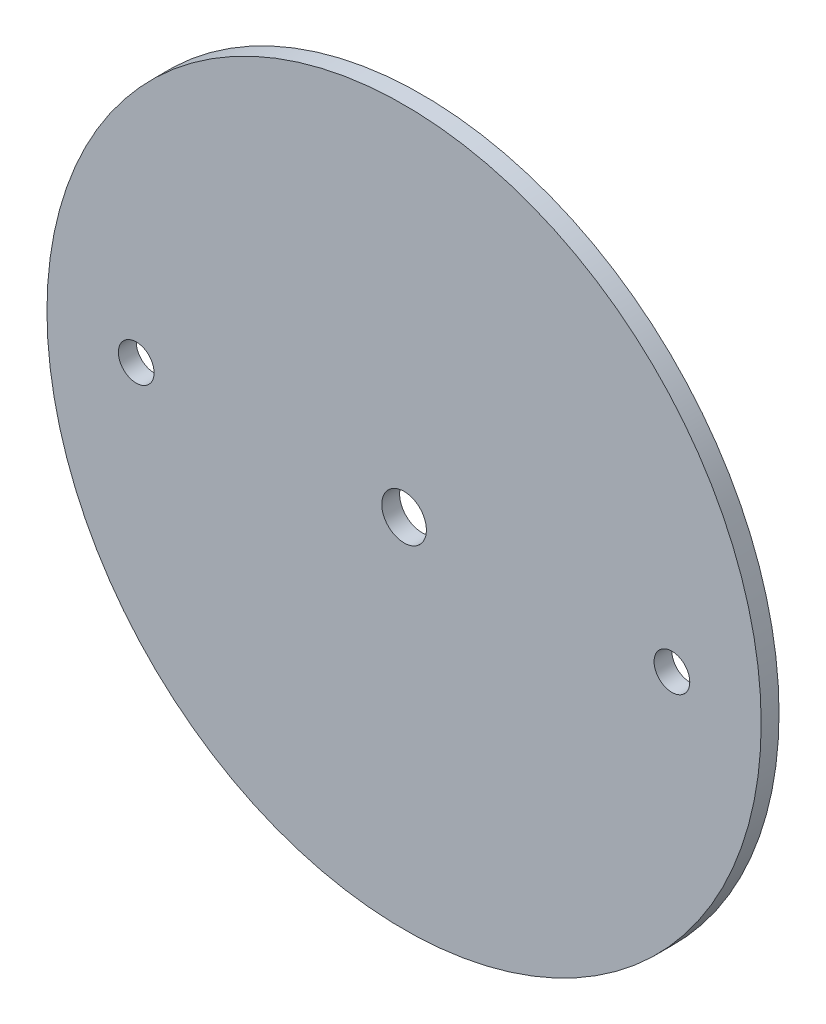
ISO-10303-21;
HEADER;
FILE_DESCRIPTION(('STEP AP214'),'2;1');
FILE_NAME('part.step','',(''),(''),'','','');
FILE_SCHEMA(('AUTOMOTIVE_DESIGN { 1 0 10303 214 1 1 1 1 }'));
ENDSEC;
DATA;
#1=APPLICATION_CONTEXT('core data for automotive mechanical design processes');
#2=APPLICATION_PROTOCOL_DEFINITION('international standard','automotive_design',2000,#1);
#3=PRODUCT_CONTEXT('',#1,'mechanical');
#4=PRODUCT('Part','Part','',(#3));
#5=PRODUCT_RELATED_PRODUCT_CATEGORY('part','',(#4));
#6=PRODUCT_DEFINITION_FORMATION('','',#4);
#7=PRODUCT_DEFINITION_CONTEXT('part definition',#1,'design');
#8=PRODUCT_DEFINITION('design','',#6,#7);
#9=PRODUCT_DEFINITION_SHAPE('','',#8);
#10=(LENGTH_UNIT() NAMED_UNIT(*) SI_UNIT(.MILLI.,.METRE.));
#11=(NAMED_UNIT(*) PLANE_ANGLE_UNIT() SI_UNIT($,.RADIAN.));
#12=(NAMED_UNIT(*) SI_UNIT($,.STERADIAN.) SOLID_ANGLE_UNIT());
#13=UNCERTAINTY_MEASURE_WITH_UNIT(LENGTH_MEASURE(1.E-05),#10,'distance_accuracy_value','');
#14=(GEOMETRIC_REPRESENTATION_CONTEXT(3) GLOBAL_UNCERTAINTY_ASSIGNED_CONTEXT((#13)) GLOBAL_UNIT_ASSIGNED_CONTEXT((#10,
#11,#12)) REPRESENTATION_CONTEXT('',''));
#15=CARTESIAN_POINT('',(0.,0.,0.));
#16=DIRECTION('',(0.,0.,1.));
#17=DIRECTION('',(1.,0.,0.));
#18=AXIS2_PLACEMENT_3D('',#15,#16,#17);
#19=CARTESIAN_POINT('',(0.,0.,1.5875));
#20=DIRECTION('',(0.,0.,-1.));
#21=DIRECTION('',(-1.,0.,0.));
#22=AXIS2_PLACEMENT_3D('',#19,#20,#21);
#23=CYLINDRICAL_SURFACE('',#22,63.5);
#24=CARTESIAN_POINT('',(0.,0.,1.5875));
#25=DIRECTION('',(0.,0.,1.));
#26=DIRECTION('',(1.,0.,0.));
#27=AXIS2_PLACEMENT_3D('',#24,#25,#26);
#28=CIRCLE('',#27,63.5);
#29=CARTESIAN_POINT('',(63.5,0.,1.5875));
#30=VERTEX_POINT('',#29);
#31=EDGE_CURVE('E10',#30,#30,#28,.T.);
#32=ORIENTED_EDGE('',*,*,#31,.F.);
#33=EDGE_LOOP('',(#32));
#34=FACE_BOUND('',#33,.T.);
#35=CARTESIAN_POINT('',(0.,0.,-1.5875));
#36=DIRECTION('',(0.,0.,1.));
#37=DIRECTION('',(1.,0.,0.));
#38=AXIS2_PLACEMENT_3D('',#35,#36,#37);
#39=CIRCLE('',#38,63.5);
#40=CARTESIAN_POINT('',(63.5,0.,-1.5875));
#41=VERTEX_POINT('',#40);
#42=EDGE_CURVE('E44',#41,#41,#39,.T.);
#43=ORIENTED_EDGE('',*,*,#42,.T.);
#44=EDGE_LOOP('',(#43));
#45=FACE_BOUND('',#44,.T.);
#46=ADVANCED_FACE('F37',(#34,#45),#23,.T.);
#47=CARTESIAN_POINT('',(0.,0.,1.5875));
#48=DIRECTION('',(0.,0.,1.));
#49=DIRECTION('',(1.,0.,0.));
#50=AXIS2_PLACEMENT_3D('',#47,#48,#49);
#51=PLANE('',#50);
#52=CARTESIAN_POINT('',(0.,0.,1.5875));
#53=DIRECTION('',(0.,0.,1.));
#54=DIRECTION('',(1.,0.,0.));
#55=AXIS2_PLACEMENT_3D('',#52,#53,#54);
#56=CIRCLE('',#55,3.96875);
#57=CARTESIAN_POINT('',(3.96875,0.,1.5875));
#58=VERTEX_POINT('',#57);
#59=EDGE_CURVE('E62',#58,#58,#56,.T.);
#60=ORIENTED_EDGE('',*,*,#59,.F.);
#61=EDGE_LOOP('',(#60));
#62=FACE_BOUND('',#61,.T.);
#63=CARTESIAN_POINT('',(47.625,0.,1.5875));
#64=DIRECTION('',(0.,0.,1.));
#65=DIRECTION('',(1.,0.,0.));
#66=AXIS2_PLACEMENT_3D('',#63,#64,#65);
#67=CIRCLE('',#66,3.17499999999998);
#68=CARTESIAN_POINT('',(50.8,0.,1.5875));
#69=VERTEX_POINT('',#68);
#70=EDGE_CURVE('E59',#69,#69,#67,.T.);
#71=ORIENTED_EDGE('',*,*,#70,.F.);
#72=EDGE_LOOP('',(#71));
#73=FACE_BOUND('',#72,.T.);
#74=CARTESIAN_POINT('',(-47.625,0.,1.5875));
#75=DIRECTION('',(0.,0.,1.));
#76=DIRECTION('',(1.,0.,0.));
#77=AXIS2_PLACEMENT_3D('',#74,#75,#76);
#78=CIRCLE('',#77,3.17499999999998);
#79=CARTESIAN_POINT('',(-44.45,0.,1.5875));
#80=VERTEX_POINT('',#79);
#81=EDGE_CURVE('E53',#80,#80,#78,.T.);
#82=ORIENTED_EDGE('',*,*,#81,.F.);
#83=EDGE_LOOP('',(#82));
#84=FACE_BOUND('',#83,.T.);
#85=ORIENTED_EDGE('',*,*,#31,.T.);
#86=EDGE_LOOP('',(#85));
#87=FACE_BOUND('',#86,.T.);
#88=ADVANCED_FACE('F84',(#62,#73,#84,#87),#51,.T.);
#89=CARTESIAN_POINT('',(0.,0.,-1.5875));
#90=DIRECTION('',(0.,0.,1.));
#91=DIRECTION('',(1.,0.,0.));
#92=AXIS2_PLACEMENT_3D('',#89,#90,#91);
#93=PLANE('',#92);
#94=CARTESIAN_POINT('',(0.,0.,-1.5875));
#95=DIRECTION('',(0.,0.,1.));
#96=DIRECTION('',(1.,0.,0.));
#97=AXIS2_PLACEMENT_3D('',#94,#95,#96);
#98=CIRCLE('',#97,3.96875);
#99=CARTESIAN_POINT('',(3.96875,0.,-1.5875));
#100=VERTEX_POINT('',#99);
#101=EDGE_CURVE('E40',#100,#100,#98,.T.);
#102=ORIENTED_EDGE('',*,*,#101,.T.);
#103=EDGE_LOOP('',(#102));
#104=FACE_BOUND('',#103,.T.);
#105=CARTESIAN_POINT('',(47.625,0.,-1.5875));
#106=DIRECTION('',(0.,0.,1.));
#107=DIRECTION('',(1.,0.,0.));
#108=AXIS2_PLACEMENT_3D('',#105,#106,#107);
#109=CIRCLE('',#108,3.175);
#110=CARTESIAN_POINT('',(50.8,0.,-1.5875));
#111=VERTEX_POINT('',#110);
#112=EDGE_CURVE('E56',#111,#111,#109,.T.);
#113=ORIENTED_EDGE('',*,*,#112,.T.);
#114=EDGE_LOOP('',(#113));
#115=FACE_BOUND('',#114,.T.);
#116=CARTESIAN_POINT('',(-47.625,0.,-1.5875));
#117=DIRECTION('',(0.,0.,1.));
#118=DIRECTION('',(1.,0.,0.));
#119=AXIS2_PLACEMENT_3D('',#116,#117,#118);
#120=CIRCLE('',#119,3.175);
#121=CARTESIAN_POINT('',(-44.45,0.,-1.5875));
#122=VERTEX_POINT('',#121);
#123=EDGE_CURVE('E49',#122,#122,#120,.T.);
#124=ORIENTED_EDGE('',*,*,#123,.T.);
#125=EDGE_LOOP('',(#124));
#126=FACE_BOUND('',#125,.T.);
#127=ORIENTED_EDGE('',*,*,#42,.F.);
#128=EDGE_LOOP('',(#127));
#129=FACE_BOUND('',#128,.T.);
#130=ADVANCED_FACE('F69',(#104,#115,#126,#129),#93,.F.);
#131=CARTESIAN_POINT('',(-47.625,0.,1.5875));
#132=DIRECTION('',(0.,0.,1.));
#133=DIRECTION('',(1.,0.,0.));
#134=AXIS2_PLACEMENT_3D('',#131,#132,#133);
#135=CYLINDRICAL_SURFACE('',#134,3.17499999999999);
#136=ORIENTED_EDGE('',*,*,#123,.F.);
#137=EDGE_LOOP('',(#136));
#138=FACE_BOUND('',#137,.T.);
#139=ORIENTED_EDGE('',*,*,#81,.T.);
#140=EDGE_LOOP('',(#139));
#141=FACE_BOUND('',#140,.T.);
#142=ADVANCED_FACE('F80',(#138,#141),#135,.F.);
#143=CARTESIAN_POINT('',(47.625,0.,1.5875));
#144=DIRECTION('',(0.,0.,1.));
#145=DIRECTION('',(1.,0.,0.));
#146=AXIS2_PLACEMENT_3D('',#143,#144,#145);
#147=CYLINDRICAL_SURFACE('',#146,3.17499999999999);
#148=ORIENTED_EDGE('',*,*,#112,.F.);
#149=EDGE_LOOP('',(#148));
#150=FACE_BOUND('',#149,.T.);
#151=ORIENTED_EDGE('',*,*,#70,.T.);
#152=EDGE_LOOP('',(#151));
#153=FACE_BOUND('',#152,.T.);
#154=ADVANCED_FACE('F74',(#150,#153),#147,.F.);
#155=CARTESIAN_POINT('',(0.,0.,1.5875));
#156=DIRECTION('',(0.,0.,1.));
#157=DIRECTION('',(1.,0.,0.));
#158=AXIS2_PLACEMENT_3D('',#155,#156,#157);
#159=CYLINDRICAL_SURFACE('',#158,3.96875);
#160=ORIENTED_EDGE('',*,*,#59,.T.);
#161=EDGE_LOOP('',(#160));
#162=FACE_BOUND('',#161,.T.);
#163=ORIENTED_EDGE('',*,*,#101,.F.);
#164=EDGE_LOOP('',(#163));
#165=FACE_BOUND('',#164,.T.);
#166=ADVANCED_FACE('F72',(#162,#165),#159,.F.);
#167=CLOSED_SHELL('',(#46,#88,#130,#142,#154,#166));
#168=MANIFOLD_SOLID_BREP('B2',#167);
#169=ADVANCED_BREP_SHAPE_REPRESENTATION('',(#18,#168),#14);
#170=SHAPE_DEFINITION_REPRESENTATION(#9,#169);
ENDSEC;
END-ISO-10303-21;
